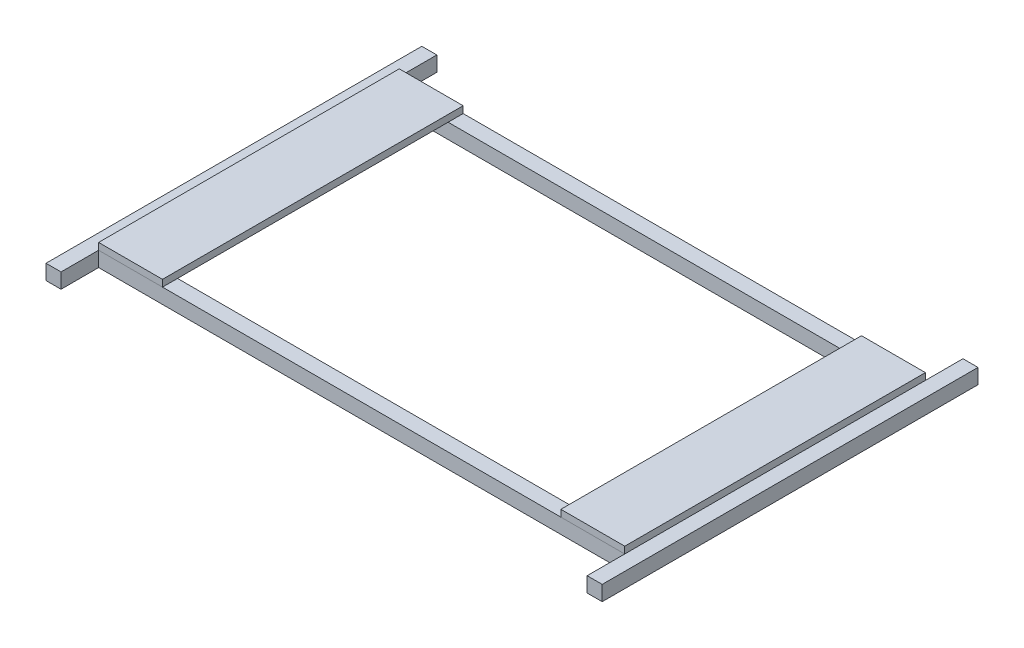
ISO-10303-21;
HEADER;
FILE_DESCRIPTION(('STEP AP214'),'2;1');
FILE_NAME('part.step','',(''),(''),'','','');
FILE_SCHEMA(('AUTOMOTIVE_DESIGN { 1 0 10303 214 1 1 1 1 }'));
ENDSEC;
DATA;
#1=APPLICATION_CONTEXT('core data for automotive mechanical design processes');
#2=APPLICATION_PROTOCOL_DEFINITION('international standard','automotive_design',2000,#1);
#3=PRODUCT_CONTEXT('',#1,'mechanical');
#4=PRODUCT('Part','Part','',(#3));
#5=PRODUCT_RELATED_PRODUCT_CATEGORY('part','',(#4));
#6=PRODUCT_DEFINITION_FORMATION('','',#4);
#7=PRODUCT_DEFINITION_CONTEXT('part definition',#1,'design');
#8=PRODUCT_DEFINITION('design','',#6,#7);
#9=PRODUCT_DEFINITION_SHAPE('','',#8);
#10=(LENGTH_UNIT() NAMED_UNIT(*) SI_UNIT(.MILLI.,.METRE.));
#11=(NAMED_UNIT(*) PLANE_ANGLE_UNIT() SI_UNIT($,.RADIAN.));
#12=(NAMED_UNIT(*) SI_UNIT($,.STERADIAN.) SOLID_ANGLE_UNIT());
#13=UNCERTAINTY_MEASURE_WITH_UNIT(LENGTH_MEASURE(1.E-05),#10,'distance_accuracy_value','');
#14=(GEOMETRIC_REPRESENTATION_CONTEXT(3) GLOBAL_UNCERTAINTY_ASSIGNED_CONTEXT((#13)) GLOBAL_UNIT_ASSIGNED_CONTEXT((#10,
#11,#12)) REPRESENTATION_CONTEXT('',''));
#15=CARTESIAN_POINT('',(0.,0.,0.));
#16=DIRECTION('',(0.,0.,1.));
#17=DIRECTION('',(1.,0.,0.));
#18=AXIS2_PLACEMENT_3D('',#15,#16,#17);
#19=CARTESIAN_POINT('',(365.272669908613,9.,-410.320607762815));
#20=DIRECTION('',(-1.,0.,0.));
#21=DIRECTION('',(0.,0.,1.));
#22=AXIS2_PLACEMENT_3D('',#19,#20,#21);
#23=PLANE('',#22);
#24=DIRECTION('',(0.,0.,-1.));
#25=VECTOR('',#24,1.);
#26=CARTESIAN_POINT('',(365.272669908613,0.,-410.320607762815));
#27=LINE('',#26,#25);
#28=CARTESIAN_POINT('',(365.272669908613,0.,-10.3206077628152));
#29=VERTEX_POINT('',#28);
#30=CARTESIAN_POINT('',(365.272669908613,0.,-410.320607762815));
#31=VERTEX_POINT('',#30);
#32=EDGE_CURVE('E111',#29,#31,#27,.T.);
#33=ORIENTED_EDGE('',*,*,#32,.T.);
#34=DIRECTION('',(0.,-1.,0.));
#35=VECTOR('',#34,1.);
#36=CARTESIAN_POINT('',(365.272669908613,9.,-410.320607762815));
#37=LINE('',#36,#35);
#38=CARTESIAN_POINT('',(365.272669908613,9.,-410.320607762815));
#39=VERTEX_POINT('',#38);
#40=EDGE_CURVE('E12',#39,#31,#37,.T.);
#41=ORIENTED_EDGE('',*,*,#40,.F.);
#42=DIRECTION('',(0.,0.,-1.));
#43=VECTOR('',#42,1.);
#44=CARTESIAN_POINT('',(365.272669908613,9.,-410.320607762815));
#45=LINE('',#44,#43);
#46=CARTESIAN_POINT('',(365.272669908613,9.,-10.3206077628152));
#47=VERTEX_POINT('',#46);
#48=EDGE_CURVE('E99',#47,#39,#45,.T.);
#49=ORIENTED_EDGE('',*,*,#48,.F.);
#50=DIRECTION('',(0.,-1.,0.));
#51=VECTOR('',#50,1.);
#52=CARTESIAN_POINT('',(365.272669908613,9.,-10.3206077628152));
#53=LINE('',#52,#51);
#54=EDGE_CURVE('E107',#47,#29,#53,.T.);
#55=ORIENTED_EDGE('',*,*,#54,.T.);
#56=EDGE_LOOP('',(#33,#41,#49,#55));
#57=FACE_BOUND('',#56,.T.);
#58=ADVANCED_FACE('F48',(#57),#23,.F.);
#59=CARTESIAN_POINT('',(365.272669908613,9.,-410.320607762815));
#60=DIRECTION('',(0.,0.,1.));
#61=DIRECTION('',(1.,0.,0.));
#62=AXIS2_PLACEMENT_3D('',#59,#60,#61);
#63=PLANE('',#62);
#64=DIRECTION('',(-1.,0.,0.));
#65=VECTOR('',#64,1.);
#66=CARTESIAN_POINT('',(365.272669908613,0.,-410.320607762815));
#67=LINE('',#66,#65);
#68=CARTESIAN_POINT('',(280.272669908613,0.,-410.320607762815));
#69=VERTEX_POINT('',#68);
#70=EDGE_CURVE('E103',#31,#69,#67,.T.);
#71=ORIENTED_EDGE('',*,*,#70,.T.);
#72=DIRECTION('',(0.,-1.,0.));
#73=VECTOR('',#72,1.);
#74=CARTESIAN_POINT('',(280.272669908613,9.,-410.320607762815));
#75=LINE('',#74,#73);
#76=CARTESIAN_POINT('',(280.272669908613,9.,-410.320607762815));
#77=VERTEX_POINT('',#76);
#78=EDGE_CURVE('E56',#77,#69,#75,.T.);
#79=ORIENTED_EDGE('',*,*,#78,.F.);
#80=DIRECTION('',(-1.,0.,0.));
#81=VECTOR('',#80,1.);
#82=CARTESIAN_POINT('',(365.272669908613,9.,-410.320607762815));
#83=LINE('',#82,#81);
#84=EDGE_CURVE('E94',#39,#77,#83,.T.);
#85=ORIENTED_EDGE('',*,*,#84,.F.);
#86=ORIENTED_EDGE('',*,*,#40,.T.);
#87=EDGE_LOOP('',(#71,#79,#85,#86));
#88=FACE_BOUND('',#87,.T.);
#89=ADVANCED_FACE('F102',(#88),#63,.F.);
#90=CARTESIAN_POINT('',(280.272669908613,9.,-410.320607762815));
#91=DIRECTION('',(1.,0.,0.));
#92=DIRECTION('',(0.,0.,-1.));
#93=AXIS2_PLACEMENT_3D('',#90,#91,#92);
#94=PLANE('',#93);
#95=DIRECTION('',(0.,0.,1.));
#96=VECTOR('',#95,1.);
#97=CARTESIAN_POINT('',(280.272669908613,0.,-410.320607762815));
#98=LINE('',#97,#96);
#99=CARTESIAN_POINT('',(280.272669908613,0.,-10.3206077628152));
#100=VERTEX_POINT('',#99);
#101=EDGE_CURVE('E81',#69,#100,#98,.T.);
#102=ORIENTED_EDGE('',*,*,#101,.T.);
#103=DIRECTION('',(0.,-1.,0.));
#104=VECTOR('',#103,1.);
#105=CARTESIAN_POINT('',(280.272669908613,9.,-10.3206077628152));
#106=LINE('',#105,#104);
#107=CARTESIAN_POINT('',(280.272669908613,9.,-10.3206077628152));
#108=VERTEX_POINT('',#107);
#109=EDGE_CURVE('E104',#108,#100,#106,.T.);
#110=ORIENTED_EDGE('',*,*,#109,.F.);
#111=DIRECTION('',(0.,0.,1.));
#112=VECTOR('',#111,1.);
#113=CARTESIAN_POINT('',(280.272669908613,9.,-410.320607762815));
#114=LINE('',#113,#112);
#115=EDGE_CURVE('E97',#77,#108,#114,.T.);
#116=ORIENTED_EDGE('',*,*,#115,.F.);
#117=ORIENTED_EDGE('',*,*,#78,.T.);
#118=EDGE_LOOP('',(#102,#110,#116,#117));
#119=FACE_BOUND('',#118,.T.);
#120=ADVANCED_FACE('F105',(#119),#94,.F.);
#121=CARTESIAN_POINT('',(365.272669908613,9.,-10.3206077628152));
#122=DIRECTION('',(0.,0.,-1.));
#123=DIRECTION('',(-1.,0.,0.));
#124=AXIS2_PLACEMENT_3D('',#121,#122,#123);
#125=PLANE('',#124);
#126=DIRECTION('',(1.,0.,0.));
#127=VECTOR('',#126,1.);
#128=CARTESIAN_POINT('',(365.272669908613,0.,-10.3206077628152));
#129=LINE('',#128,#127);
#130=EDGE_CURVE('E87',#100,#29,#129,.T.);
#131=ORIENTED_EDGE('',*,*,#130,.T.);
#132=ORIENTED_EDGE('',*,*,#54,.F.);
#133=DIRECTION('',(1.,0.,0.));
#134=VECTOR('',#133,1.);
#135=CARTESIAN_POINT('',(365.272669908613,9.,-10.3206077628152));
#136=LINE('',#135,#134);
#137=EDGE_CURVE('E64',#108,#47,#136,.T.);
#138=ORIENTED_EDGE('',*,*,#137,.F.);
#139=ORIENTED_EDGE('',*,*,#109,.T.);
#140=EDGE_LOOP('',(#131,#132,#138,#139));
#141=FACE_BOUND('',#140,.T.);
#142=ADVANCED_FACE('F118',(#141),#125,.F.);
#143=CARTESIAN_POINT('',(0.,9.,0.));
#144=DIRECTION('',(0.,-1.,0.));
#145=DIRECTION('',(0.,0.,-1.));
#146=AXIS2_PLACEMENT_3D('',#143,#144,#145);
#147=PLANE('',#146);
#148=ORIENTED_EDGE('',*,*,#48,.T.);
#149=ORIENTED_EDGE('',*,*,#84,.T.);
#150=ORIENTED_EDGE('',*,*,#115,.T.);
#151=ORIENTED_EDGE('',*,*,#137,.T.);
#152=EDGE_LOOP('',(#148,#149,#150,#151));
#153=FACE_BOUND('',#152,.T.);
#154=ADVANCED_FACE('F95',(#153),#147,.F.);
#155=CARTESIAN_POINT('',(0.,0.,0.));
#156=DIRECTION('',(0.,-1.,0.));
#157=DIRECTION('',(0.,0.,-1.));
#158=AXIS2_PLACEMENT_3D('',#155,#156,#157);
#159=PLANE('',#158);
#160=ORIENTED_EDGE('',*,*,#32,.F.);
#161=ORIENTED_EDGE('',*,*,#130,.F.);
#162=ORIENTED_EDGE('',*,*,#101,.F.);
#163=ORIENTED_EDGE('',*,*,#70,.F.);
#164=EDGE_LOOP('',(#160,#161,#162,#163));
#165=FACE_BOUND('',#164,.T.);
#166=ADVANCED_FACE('F121',(#165),#159,.T.);
#167=CLOSED_SHELL('',(#58,#89,#120,#142,#154,#166));
#168=MANIFOLD_SOLID_BREP('B2',#167);
#169=CARTESIAN_POINT('',(-334.727330091387,9.,-410.320607762815));
#170=DIRECTION('',(1.,0.,0.));
#171=DIRECTION('',(0.,0.,-1.));
#172=AXIS2_PLACEMENT_3D('',#169,#170,#171);
#173=PLANE('',#172);
#174=DIRECTION('',(0.,0.,1.));
#175=VECTOR('',#174,1.);
#176=CARTESIAN_POINT('',(-334.727330091387,0.,-410.320607762815));
#177=LINE('',#176,#175);
#178=CARTESIAN_POINT('',(-334.727330091387,0.,-410.320607762815));
#179=VERTEX_POINT('',#178);
#180=CARTESIAN_POINT('',(-334.727330091387,0.,-10.3206077628152));
#181=VERTEX_POINT('',#180);
#182=EDGE_CURVE('E244',#179,#181,#177,.T.);
#183=ORIENTED_EDGE('',*,*,#182,.T.);
#184=DIRECTION('',(0.,-1.,0.));
#185=VECTOR('',#184,1.);
#186=CARTESIAN_POINT('',(-334.727330091387,9.,-10.3206077628152));
#187=LINE('',#186,#185);
#188=CARTESIAN_POINT('',(-334.727330091387,9.,-10.3206077628152));
#189=VERTEX_POINT('',#188);
#190=EDGE_CURVE('E46',#189,#181,#187,.T.);
#191=ORIENTED_EDGE('',*,*,#190,.F.);
#192=DIRECTION('',(0.,0.,1.));
#193=VECTOR('',#192,1.);
#194=CARTESIAN_POINT('',(-334.727330091387,9.,-410.320607762815));
#195=LINE('',#194,#193);
#196=CARTESIAN_POINT('',(-334.727330091387,9.,-410.320607762815));
#197=VERTEX_POINT('',#196);
#198=EDGE_CURVE('E232',#197,#189,#195,.T.);
#199=ORIENTED_EDGE('',*,*,#198,.F.);
#200=DIRECTION('',(0.,-1.,0.));
#201=VECTOR('',#200,1.);
#202=CARTESIAN_POINT('',(-334.727330091387,9.,-410.320607762815));
#203=LINE('',#202,#201);
#204=EDGE_CURVE('E240',#197,#179,#203,.T.);
#205=ORIENTED_EDGE('',*,*,#204,.T.);
#206=EDGE_LOOP('',(#183,#191,#199,#205));
#207=FACE_BOUND('',#206,.T.);
#208=ADVANCED_FACE('F181',(#207),#173,.F.);
#209=CARTESIAN_POINT('',(-334.727330091387,9.,-10.3206077628152));
#210=DIRECTION('',(0.,0.,-1.));
#211=DIRECTION('',(-1.,0.,0.));
#212=AXIS2_PLACEMENT_3D('',#209,#210,#211);
#213=PLANE('',#212);
#214=DIRECTION('',(1.,0.,0.));
#215=VECTOR('',#214,1.);
#216=CARTESIAN_POINT('',(-334.727330091387,0.,-10.3206077628152));
#217=LINE('',#216,#215);
#218=CARTESIAN_POINT('',(-249.727330091387,0.,-10.3206077628152));
#219=VERTEX_POINT('',#218);
#220=EDGE_CURVE('E236',#181,#219,#217,.T.);
#221=ORIENTED_EDGE('',*,*,#220,.T.);
#222=DIRECTION('',(0.,-1.,0.));
#223=VECTOR('',#222,1.);
#224=CARTESIAN_POINT('',(-249.727330091387,9.,-10.3206077628152));
#225=LINE('',#224,#223);
#226=CARTESIAN_POINT('',(-249.727330091387,9.,-10.3206077628152));
#227=VERTEX_POINT('',#226);
#228=EDGE_CURVE('E189',#227,#219,#225,.T.);
#229=ORIENTED_EDGE('',*,*,#228,.F.);
#230=DIRECTION('',(1.,0.,0.));
#231=VECTOR('',#230,1.);
#232=CARTESIAN_POINT('',(-334.727330091387,9.,-10.3206077628152));
#233=LINE('',#232,#231);
#234=EDGE_CURVE('E227',#189,#227,#233,.T.);
#235=ORIENTED_EDGE('',*,*,#234,.F.);
#236=ORIENTED_EDGE('',*,*,#190,.T.);
#237=EDGE_LOOP('',(#221,#229,#235,#236));
#238=FACE_BOUND('',#237,.T.);
#239=ADVANCED_FACE('F235',(#238),#213,.F.);
#240=CARTESIAN_POINT('',(-249.727330091387,9.,-410.320607762815));
#241=DIRECTION('',(-1.,0.,0.));
#242=DIRECTION('',(0.,0.,1.));
#243=AXIS2_PLACEMENT_3D('',#240,#241,#242);
#244=PLANE('',#243);
#245=DIRECTION('',(0.,0.,-1.));
#246=VECTOR('',#245,1.);
#247=CARTESIAN_POINT('',(-249.727330091387,0.,-410.320607762815));
#248=LINE('',#247,#246);
#249=CARTESIAN_POINT('',(-249.727330091387,0.,-410.320607762815));
#250=VERTEX_POINT('',#249);
#251=EDGE_CURVE('E214',#219,#250,#248,.T.);
#252=ORIENTED_EDGE('',*,*,#251,.T.);
#253=DIRECTION('',(0.,-1.,0.));
#254=VECTOR('',#253,1.);
#255=CARTESIAN_POINT('',(-249.727330091387,9.,-410.320607762815));
#256=LINE('',#255,#254);
#257=CARTESIAN_POINT('',(-249.727330091387,9.,-410.320607762815));
#258=VERTEX_POINT('',#257);
#259=EDGE_CURVE('E237',#258,#250,#256,.T.);
#260=ORIENTED_EDGE('',*,*,#259,.F.);
#261=DIRECTION('',(0.,0.,-1.));
#262=VECTOR('',#261,1.);
#263=CARTESIAN_POINT('',(-249.727330091387,9.,-410.320607762815));
#264=LINE('',#263,#262);
#265=EDGE_CURVE('E230',#227,#258,#264,.T.);
#266=ORIENTED_EDGE('',*,*,#265,.F.);
#267=ORIENTED_EDGE('',*,*,#228,.T.);
#268=EDGE_LOOP('',(#252,#260,#266,#267));
#269=FACE_BOUND('',#268,.T.);
#270=ADVANCED_FACE('F238',(#269),#244,.F.);
#271=CARTESIAN_POINT('',(-334.727330091387,9.,-410.320607762815));
#272=DIRECTION('',(0.,0.,1.));
#273=DIRECTION('',(1.,0.,0.));
#274=AXIS2_PLACEMENT_3D('',#271,#272,#273);
#275=PLANE('',#274);
#276=DIRECTION('',(-1.,0.,0.));
#277=VECTOR('',#276,1.);
#278=CARTESIAN_POINT('',(-334.727330091387,0.,-410.320607762815));
#279=LINE('',#278,#277);
#280=EDGE_CURVE('E220',#250,#179,#279,.T.);
#281=ORIENTED_EDGE('',*,*,#280,.T.);
#282=ORIENTED_EDGE('',*,*,#204,.F.);
#283=DIRECTION('',(-1.,0.,0.));
#284=VECTOR('',#283,1.);
#285=CARTESIAN_POINT('',(-334.727330091387,9.,-410.320607762815));
#286=LINE('',#285,#284);
#287=EDGE_CURVE('E197',#258,#197,#286,.T.);
#288=ORIENTED_EDGE('',*,*,#287,.F.);
#289=ORIENTED_EDGE('',*,*,#259,.T.);
#290=EDGE_LOOP('',(#281,#282,#288,#289));
#291=FACE_BOUND('',#290,.T.);
#292=ADVANCED_FACE('F251',(#291),#275,.F.);
#293=CARTESIAN_POINT('',(0.,9.,0.));
#294=DIRECTION('',(0.,1.,0.));
#295=DIRECTION('',(0.,0.,1.));
#296=AXIS2_PLACEMENT_3D('',#293,#294,#295);
#297=PLANE('',#296);
#298=ORIENTED_EDGE('',*,*,#198,.T.);
#299=ORIENTED_EDGE('',*,*,#234,.T.);
#300=ORIENTED_EDGE('',*,*,#265,.T.);
#301=ORIENTED_EDGE('',*,*,#287,.T.);
#302=EDGE_LOOP('',(#298,#299,#300,#301));
#303=FACE_BOUND('',#302,.T.);
#304=ADVANCED_FACE('F228',(#303),#297,.T.);
#305=CARTESIAN_POINT('',(0.,0.,0.));
#306=DIRECTION('',(0.,1.,0.));
#307=DIRECTION('',(0.,0.,1.));
#308=AXIS2_PLACEMENT_3D('',#305,#306,#307);
#309=PLANE('',#308);
#310=ORIENTED_EDGE('',*,*,#182,.F.);
#311=ORIENTED_EDGE('',*,*,#280,.F.);
#312=ORIENTED_EDGE('',*,*,#251,.F.);
#313=ORIENTED_EDGE('',*,*,#220,.F.);
#314=EDGE_LOOP('',(#310,#311,#312,#313));
#315=FACE_BOUND('',#314,.T.);
#316=ADVANCED_FACE('F254',(#315),#309,.F.);
#317=CLOSED_SHELL('',(#208,#239,#270,#292,#304,#316));
#318=MANIFOLD_SOLID_BREP('B6',#317);
#319=CARTESIAN_POINT('',(0.,-20.,-30.3206077628152));
#320=DIRECTION('',(0.,0.,1.));
#321=DIRECTION('',(1.,0.,0.));
#322=AXIS2_PLACEMENT_3D('',#319,#320,#321);
#323=PLANE('',#322);
#324=DIRECTION('',(1.,0.,0.));
#325=VECTOR('',#324,1.);
#326=CARTESIAN_POINT('',(0.,0.,-30.3206077628152));
#327=LINE('',#326,#325);
#328=CARTESIAN_POINT('',(-334.727330091387,0.,-30.3206077628152));
#329=VERTEX_POINT('',#328);
#330=CARTESIAN_POINT('',(365.272669908613,0.,-30.3206077628152));
#331=VERTEX_POINT('',#330);
#332=EDGE_CURVE('E478',#329,#331,#327,.T.);
#333=ORIENTED_EDGE('',*,*,#332,.T.);
#334=DIRECTION('',(0.,1.,0.));
#335=VECTOR('',#334,1.);
#336=CARTESIAN_POINT('',(365.272669908613,-20.,-30.3206077628152));
#337=LINE('',#336,#335);
#338=CARTESIAN_POINT('',(365.272669908613,-20.,-30.3206077628152));
#339=VERTEX_POINT('',#338);
#340=EDGE_CURVE('E179',#339,#331,#337,.T.);
#341=ORIENTED_EDGE('',*,*,#340,.F.);
#342=DIRECTION('',(1.,0.,0.));
#343=VECTOR('',#342,1.);
#344=CARTESIAN_POINT('',(0.,-20.,-30.3206077628152));
#345=LINE('',#344,#343);
#346=CARTESIAN_POINT('',(-334.727330091387,-20.,-30.3206077628152));
#347=VERTEX_POINT('',#346);
#348=EDGE_CURVE('E324',#347,#339,#345,.T.);
#349=ORIENTED_EDGE('',*,*,#348,.F.);
#350=DIRECTION('',(0.,1.,0.));
#351=VECTOR('',#350,1.);
#352=CARTESIAN_POINT('',(-334.727330091387,-20.,-30.3206077628152));
#353=LINE('',#352,#351);
#354=EDGE_CURVE('E433',#347,#329,#353,.T.);
#355=ORIENTED_EDGE('',*,*,#354,.T.);
#356=EDGE_LOOP('',(#333,#341,#349,#355));
#357=FACE_BOUND('',#356,.T.);
#358=ADVANCED_FACE('F305',(#357),#323,.F.);
#359=CARTESIAN_POINT('',(365.272669908613,-20.,0.));
#360=DIRECTION('',(-1.,0.,0.));
#361=DIRECTION('',(0.,0.,1.));
#362=AXIS2_PLACEMENT_3D('',#359,#360,#361);
#363=PLANE('',#362);
#364=DIRECTION('',(0.,0.,1.));
#365=VECTOR('',#364,1.);
#366=CARTESIAN_POINT('',(365.272669908613,0.,0.));
#367=LINE('',#366,#365);
#368=CARTESIAN_POINT('',(365.272669908613,0.,-390.320607762815));
#369=VERTEX_POINT('',#368);
#370=EDGE_CURVE('E483',#369,#331,#367,.T.);
#371=ORIENTED_EDGE('',*,*,#370,.F.);
#372=DIRECTION('',(0.,1.,0.));
#373=VECTOR('',#372,1.);
#374=CARTESIAN_POINT('',(365.272669908613,-20.,-390.320607762815));
#375=LINE('',#374,#373);
#376=CARTESIAN_POINT('',(365.272669908613,-20.,-390.320607762815));
#377=VERTEX_POINT('',#376);
#378=EDGE_CURVE('E315',#377,#369,#375,.T.);
#379=ORIENTED_EDGE('',*,*,#378,.F.);
#380=DIRECTION('',(0.,0.,1.));
#381=VECTOR('',#380,1.);
#382=CARTESIAN_POINT('',(365.272669908613,-20.,0.));
#383=LINE('',#382,#381);
#384=EDGE_CURVE('E441',#377,#339,#383,.T.);
#385=ORIENTED_EDGE('',*,*,#384,.T.);
#386=ORIENTED_EDGE('',*,*,#340,.T.);
#387=EDGE_LOOP('',(#371,#379,#385,#386));
#388=FACE_BOUND('',#387,.T.);
#389=ADVANCED_FACE('F537',(#388),#363,.T.);
#390=CARTESIAN_POINT('',(0.,-20.,-390.320607762815));
#391=DIRECTION('',(0.,0.,1.));
#392=DIRECTION('',(1.,0.,0.));
#393=AXIS2_PLACEMENT_3D('',#390,#391,#392);
#394=PLANE('',#393);
#395=DIRECTION('',(1.,0.,0.));
#396=VECTOR('',#395,1.);
#397=CARTESIAN_POINT('',(0.,0.,-390.320607762815));
#398=LINE('',#397,#396);
#399=CARTESIAN_POINT('',(-334.727330091387,0.,-390.320607762815));
#400=VERTEX_POINT('',#399);
#401=EDGE_CURVE('E430',#400,#369,#398,.T.);
#402=ORIENTED_EDGE('',*,*,#401,.F.);
#403=DIRECTION('',(0.,1.,0.));
#404=VECTOR('',#403,1.);
#405=CARTESIAN_POINT('',(-334.727330091387,-20.,-390.320607762815));
#406=LINE('',#405,#404);
#407=CARTESIAN_POINT('',(-334.727330091387,-20.,-390.320607762815));
#408=VERTEX_POINT('',#407);
#409=EDGE_CURVE('E425',#408,#400,#406,.T.);
#410=ORIENTED_EDGE('',*,*,#409,.F.);
#411=DIRECTION('',(1.,0.,0.));
#412=VECTOR('',#411,1.);
#413=CARTESIAN_POINT('',(0.,-20.,-390.320607762815));
#414=LINE('',#413,#412);
#415=EDGE_CURVE('E429',#408,#377,#414,.T.);
#416=ORIENTED_EDGE('',*,*,#415,.T.);
#417=ORIENTED_EDGE('',*,*,#378,.T.);
#418=EDGE_LOOP('',(#402,#410,#416,#417));
#419=FACE_BOUND('',#418,.T.);
#420=ADVANCED_FACE('F427',(#419),#394,.T.);
#421=CARTESIAN_POINT('',(-334.727330091387,-20.,0.));
#422=DIRECTION('',(-1.,0.,0.));
#423=DIRECTION('',(0.,0.,1.));
#424=AXIS2_PLACEMENT_3D('',#421,#422,#423);
#425=PLANE('',#424);
#426=DIRECTION('',(0.,0.,1.));
#427=VECTOR('',#426,1.);
#428=CARTESIAN_POINT('',(-334.727330091387,0.,0.));
#429=LINE('',#428,#427);
#430=CARTESIAN_POINT('',(-334.727330091387,0.,-10.3206077628152));
#431=VERTEX_POINT('',#430);
#432=CARTESIAN_POINT('',(-334.727330091387,0.,39.6793922371848));
#433=VERTEX_POINT('',#432);
#434=EDGE_CURVE('E446',#431,#433,#429,.T.);
#435=ORIENTED_EDGE('',*,*,#434,.T.);
#436=DIRECTION('',(0.,1.,0.));
#437=VECTOR('',#436,1.);
#438=CARTESIAN_POINT('',(-334.727330091387,-20.,39.6793922371848));
#439=LINE('',#438,#437);
#440=CARTESIAN_POINT('',(-334.727330091387,-20.,39.6793922371848));
#441=VERTEX_POINT('',#440);
#442=EDGE_CURVE('E489',#441,#433,#439,.T.);
#443=ORIENTED_EDGE('',*,*,#442,.F.);
#444=DIRECTION('',(0.,0.,1.));
#445=VECTOR('',#444,1.);
#446=CARTESIAN_POINT('',(-334.727330091387,-20.,0.));
#447=LINE('',#446,#445);
#448=CARTESIAN_POINT('',(-334.727330091387,-20.,-10.3206077628152));
#449=VERTEX_POINT('',#448);
#450=EDGE_CURVE('E485',#449,#441,#447,.T.);
#451=ORIENTED_EDGE('',*,*,#450,.F.);
#452=DIRECTION('',(0.,1.,0.));
#453=VECTOR('',#452,1.);
#454=CARTESIAN_POINT('',(-334.727330091387,-20.,-10.3206077628152));
#455=LINE('',#454,#453);
#456=EDGE_CURVE('E309',#449,#431,#455,.T.);
#457=ORIENTED_EDGE('',*,*,#456,.T.);
#458=EDGE_LOOP('',(#435,#443,#451,#457));
#459=FACE_BOUND('',#458,.T.);
#460=ADVANCED_FACE('F307',(#459),#425,.F.);
#461=CARTESIAN_POINT('',(0.,-20.,39.6793922371847));
#462=DIRECTION('',(0.,0.,-1.));
#463=DIRECTION('',(-1.,0.,0.));
#464=AXIS2_PLACEMENT_3D('',#461,#462,#463);
#465=PLANE('',#464);
#466=DIRECTION('',(-1.,0.,0.));
#467=VECTOR('',#466,1.);
#468=CARTESIAN_POINT('',(0.,0.,39.6793922371847));
#469=LINE('',#468,#467);
#470=CARTESIAN_POINT('',(-354.727330091387,0.,39.6793922371848));
#471=VERTEX_POINT('',#470);
#472=EDGE_CURVE('E476',#433,#471,#469,.T.);
#473=ORIENTED_EDGE('',*,*,#472,.T.);
#474=DIRECTION('',(0.,1.,0.));
#475=VECTOR('',#474,1.);
#476=CARTESIAN_POINT('',(-354.727330091387,-20.,39.6793922371848));
#477=LINE('',#476,#475);
#478=CARTESIAN_POINT('',(-354.727330091387,-20.,39.6793922371848));
#479=VERTEX_POINT('',#478);
#480=EDGE_CURVE('E492',#479,#471,#477,.T.);
#481=ORIENTED_EDGE('',*,*,#480,.F.);
#482=DIRECTION('',(-1.,0.,0.));
#483=VECTOR('',#482,1.);
#484=CARTESIAN_POINT('',(0.,-20.,39.6793922371847));
#485=LINE('',#484,#483);
#486=EDGE_CURVE('E613',#441,#479,#485,.T.);
#487=ORIENTED_EDGE('',*,*,#486,.F.);
#488=ORIENTED_EDGE('',*,*,#442,.T.);
#489=EDGE_LOOP('',(#473,#481,#487,#488));
#490=FACE_BOUND('',#489,.T.);
#491=ADVANCED_FACE('F546',(#490),#465,.F.);
#492=CARTESIAN_POINT('',(-354.727330091387,-20.,0.));
#493=DIRECTION('',(1.,0.,0.));
#494=DIRECTION('',(0.,0.,-1.));
#495=AXIS2_PLACEMENT_3D('',#492,#493,#494);
#496=PLANE('',#495);
#497=DIRECTION('',(0.,0.,-1.));
#498=VECTOR('',#497,1.);
#499=CARTESIAN_POINT('',(-354.727330091387,0.,0.));
#500=LINE('',#499,#498);
#501=CARTESIAN_POINT('',(-354.727330091387,0.,-460.320607762815));
#502=VERTEX_POINT('',#501);
#503=EDGE_CURVE('E474',#471,#502,#500,.T.);
#504=ORIENTED_EDGE('',*,*,#503,.T.);
#505=DIRECTION('',(0.,1.,0.));
#506=VECTOR('',#505,1.);
#507=CARTESIAN_POINT('',(-354.727330091387,-20.,-460.320607762815));
#508=LINE('',#507,#506);
#509=CARTESIAN_POINT('',(-354.727330091387,-20.,-460.320607762815));
#510=VERTEX_POINT('',#509);
#511=EDGE_CURVE('E495',#510,#502,#508,.T.);
#512=ORIENTED_EDGE('',*,*,#511,.F.);
#513=DIRECTION('',(0.,0.,-1.));
#514=VECTOR('',#513,1.);
#515=CARTESIAN_POINT('',(-354.727330091387,-20.,0.));
#516=LINE('',#515,#514);
#517=EDGE_CURVE('E611',#479,#510,#516,.T.);
#518=ORIENTED_EDGE('',*,*,#517,.F.);
#519=ORIENTED_EDGE('',*,*,#480,.T.);
#520=EDGE_LOOP('',(#504,#512,#518,#519));
#521=FACE_BOUND('',#520,.T.);
#522=ADVANCED_FACE('F549',(#521),#496,.F.);
#523=CARTESIAN_POINT('',(0.,-20.,-460.320607762815));
#524=DIRECTION('',(0.,0.,1.));
#525=DIRECTION('',(1.,0.,0.));
#526=AXIS2_PLACEMENT_3D('',#523,#524,#525);
#527=PLANE('',#526);
#528=DIRECTION('',(1.,0.,0.));
#529=VECTOR('',#528,1.);
#530=CARTESIAN_POINT('',(0.,0.,-460.320607762815));
#531=LINE('',#530,#529);
#532=CARTESIAN_POINT('',(-334.727330091387,0.,-460.320607762815));
#533=VERTEX_POINT('',#532);
#534=EDGE_CURVE('E472',#502,#533,#531,.T.);
#535=ORIENTED_EDGE('',*,*,#534,.T.);
#536=DIRECTION('',(0.,1.,0.));
#537=VECTOR('',#536,1.);
#538=CARTESIAN_POINT('',(-334.727330091387,-20.,-460.320607762815));
#539=LINE('',#538,#537);
#540=CARTESIAN_POINT('',(-334.727330091387,-20.,-460.320607762815));
#541=VERTEX_POINT('',#540);
#542=EDGE_CURVE('E498',#541,#533,#539,.T.);
#543=ORIENTED_EDGE('',*,*,#542,.F.);
#544=DIRECTION('',(1.,0.,0.));
#545=VECTOR('',#544,1.);
#546=CARTESIAN_POINT('',(0.,-20.,-460.320607762815));
#547=LINE('',#546,#545);
#548=EDGE_CURVE('E609',#510,#541,#547,.T.);
#549=ORIENTED_EDGE('',*,*,#548,.F.);
#550=ORIENTED_EDGE('',*,*,#511,.T.);
#551=EDGE_LOOP('',(#535,#543,#549,#550));
#552=FACE_BOUND('',#551,.T.);
#553=ADVANCED_FACE('F553',(#552),#527,.F.);
#554=CARTESIAN_POINT('',(-334.727330091387,-20.,0.));
#555=DIRECTION('',(-1.,0.,0.));
#556=DIRECTION('',(0.,0.,1.));
#557=AXIS2_PLACEMENT_3D('',#554,#555,#556);
#558=PLANE('',#557);
#559=DIRECTION('',(0.,0.,1.));
#560=VECTOR('',#559,1.);
#561=CARTESIAN_POINT('',(-334.727330091387,0.,0.));
#562=LINE('',#561,#560);
#563=CARTESIAN_POINT('',(-334.727330091387,0.,-410.320607762815));
#564=VERTEX_POINT('',#563);
#565=EDGE_CURVE('E470',#533,#564,#562,.T.);
#566=ORIENTED_EDGE('',*,*,#565,.T.);
#567=DIRECTION('',(0.,1.,0.));
#568=VECTOR('',#567,1.);
#569=CARTESIAN_POINT('',(-334.727330091387,-20.,-410.320607762815));
#570=LINE('',#569,#568);
#571=CARTESIAN_POINT('',(-334.727330091387,-20.,-410.320607762815));
#572=VERTEX_POINT('',#571);
#573=EDGE_CURVE('E501',#572,#564,#570,.T.);
#574=ORIENTED_EDGE('',*,*,#573,.F.);
#575=DIRECTION('',(0.,0.,1.));
#576=VECTOR('',#575,1.);
#577=CARTESIAN_POINT('',(-334.727330091387,-20.,0.));
#578=LINE('',#577,#576);
#579=EDGE_CURVE('E607',#541,#572,#578,.T.);
#580=ORIENTED_EDGE('',*,*,#579,.F.);
#581=ORIENTED_EDGE('',*,*,#542,.T.);
#582=EDGE_LOOP('',(#566,#574,#580,#581));
#583=FACE_BOUND('',#582,.T.);
#584=ADVANCED_FACE('F557',(#583),#558,.F.);
#585=CARTESIAN_POINT('',(0.,-20.,-410.320607762815));
#586=DIRECTION('',(0.,0.,1.));
#587=DIRECTION('',(1.,0.,0.));
#588=AXIS2_PLACEMENT_3D('',#585,#586,#587);
#589=PLANE('',#588);
#590=DIRECTION('',(1.,0.,0.));
#591=VECTOR('',#590,1.);
#592=CARTESIAN_POINT('',(0.,0.,-410.320607762815));
#593=LINE('',#592,#591);
#594=CARTESIAN_POINT('',(365.272669908613,0.,-410.320607762815));
#595=VERTEX_POINT('',#594);
#596=EDGE_CURVE('E467',#564,#595,#593,.T.);
#597=ORIENTED_EDGE('',*,*,#596,.T.);
#598=DIRECTION('',(0.,1.,0.));
#599=VECTOR('',#598,1.);
#600=CARTESIAN_POINT('',(365.272669908613,-20.,-410.320607762815));
#601=LINE('',#600,#599);
#602=CARTESIAN_POINT('',(365.272669908613,-20.,-410.320607762815));
#603=VERTEX_POINT('',#602);
#604=EDGE_CURVE('E504',#603,#595,#601,.T.);
#605=ORIENTED_EDGE('',*,*,#604,.F.);
#606=DIRECTION('',(1.,0.,0.));
#607=VECTOR('',#606,1.);
#608=CARTESIAN_POINT('',(0.,-20.,-410.320607762815));
#609=LINE('',#608,#607);
#610=EDGE_CURVE('E605',#572,#603,#609,.T.);
#611=ORIENTED_EDGE('',*,*,#610,.F.);
#612=ORIENTED_EDGE('',*,*,#573,.T.);
#613=EDGE_LOOP('',(#597,#605,#611,#612));
#614=FACE_BOUND('',#613,.T.);
#615=ADVANCED_FACE('F561',(#614),#589,.F.);
#616=CARTESIAN_POINT('',(365.272669908613,-20.,0.));
#617=DIRECTION('',(-1.,0.,0.));
#618=DIRECTION('',(0.,0.,1.));
#619=AXIS2_PLACEMENT_3D('',#616,#617,#618);
#620=PLANE('',#619);
#621=DIRECTION('',(0.,0.,1.));
#622=VECTOR('',#621,1.);
#623=CARTESIAN_POINT('',(365.272669908613,0.,0.));
#624=LINE('',#623,#622);
#625=CARTESIAN_POINT('',(365.272669908613,0.,-460.320607762815));
#626=VERTEX_POINT('',#625);
#627=EDGE_CURVE('E464',#626,#595,#624,.T.);
#628=ORIENTED_EDGE('',*,*,#627,.F.);
#629=DIRECTION('',(0.,1.,0.));
#630=VECTOR('',#629,1.);
#631=CARTESIAN_POINT('',(365.272669908613,-20.,-460.320607762815));
#632=LINE('',#631,#630);
#633=CARTESIAN_POINT('',(365.272669908613,-20.,-460.320607762815));
#634=VERTEX_POINT('',#633);
#635=EDGE_CURVE('E506',#634,#626,#632,.T.);
#636=ORIENTED_EDGE('',*,*,#635,.F.);
#637=DIRECTION('',(0.,0.,1.));
#638=VECTOR('',#637,1.);
#639=CARTESIAN_POINT('',(365.272669908613,-20.,0.));
#640=LINE('',#639,#638);
#641=EDGE_CURVE('E602',#634,#603,#640,.T.);
#642=ORIENTED_EDGE('',*,*,#641,.T.);
#643=ORIENTED_EDGE('',*,*,#604,.T.);
#644=EDGE_LOOP('',(#628,#636,#642,#643));
#645=FACE_BOUND('',#644,.T.);
#646=ADVANCED_FACE('F565',(#645),#620,.T.);
#647=CARTESIAN_POINT('',(0.,-20.,-460.320607762815));
#648=DIRECTION('',(0.,0.,1.));
#649=DIRECTION('',(1.,0.,0.));
#650=AXIS2_PLACEMENT_3D('',#647,#648,#649);
#651=PLANE('',#650);
#652=DIRECTION('',(1.,0.,0.));
#653=VECTOR('',#652,1.);
#654=CARTESIAN_POINT('',(0.,0.,-460.320607762815));
#655=LINE('',#654,#653);
#656=CARTESIAN_POINT('',(385.272669908613,0.,-460.320607762815));
#657=VERTEX_POINT('',#656);
#658=EDGE_CURVE('E461',#626,#657,#655,.T.);
#659=ORIENTED_EDGE('',*,*,#658,.T.);
#660=DIRECTION('',(0.,1.,0.));
#661=VECTOR('',#660,1.);
#662=CARTESIAN_POINT('',(385.272669908613,-20.,-460.320607762815));
#663=LINE('',#662,#661);
#664=CARTESIAN_POINT('',(385.272669908613,-20.,-460.320607762815));
#665=VERTEX_POINT('',#664);
#666=EDGE_CURVE('E508',#665,#657,#663,.T.);
#667=ORIENTED_EDGE('',*,*,#666,.F.);
#668=DIRECTION('',(1.,0.,0.));
#669=VECTOR('',#668,1.);
#670=CARTESIAN_POINT('',(0.,-20.,-460.320607762815));
#671=LINE('',#670,#669);
#672=EDGE_CURVE('E597',#634,#665,#671,.T.);
#673=ORIENTED_EDGE('',*,*,#672,.F.);
#674=ORIENTED_EDGE('',*,*,#635,.T.);
#675=EDGE_LOOP('',(#659,#667,#673,#674));
#676=FACE_BOUND('',#675,.T.);
#677=ADVANCED_FACE('F569',(#676),#651,.F.);
#678=CARTESIAN_POINT('',(385.272669908613,-20.,-1.60401970834256E-13));
#679=DIRECTION('',(1.,0.,0.));
#680=DIRECTION('',(0.,0.,-1.));
#681=AXIS2_PLACEMENT_3D('',#678,#679,#680);
#682=PLANE('',#681);
#683=DIRECTION('',(0.,0.,-1.));
#684=VECTOR('',#683,1.);
#685=CARTESIAN_POINT('',(385.272669908613,0.,-1.60401970834256E-13));
#686=LINE('',#685,#684);
#687=CARTESIAN_POINT('',(385.272669908613,0.,39.6793922371848));
#688=VERTEX_POINT('',#687);
#689=EDGE_CURVE('E458',#688,#657,#686,.T.);
#690=ORIENTED_EDGE('',*,*,#689,.F.);
#691=DIRECTION('',(0.,1.,0.));
#692=VECTOR('',#691,1.);
#693=CARTESIAN_POINT('',(385.272669908613,-20.,39.6793922371848));
#694=LINE('',#693,#692);
#695=CARTESIAN_POINT('',(385.272669908613,-20.,39.6793922371848));
#696=VERTEX_POINT('',#695);
#697=EDGE_CURVE('E510',#696,#688,#694,.T.);
#698=ORIENTED_EDGE('',*,*,#697,.F.);
#699=DIRECTION('',(0.,0.,-1.));
#700=VECTOR('',#699,1.);
#701=CARTESIAN_POINT('',(385.272669908613,-20.,-1.60401970834256E-13));
#702=LINE('',#701,#700);
#703=EDGE_CURVE('E595',#696,#665,#702,.T.);
#704=ORIENTED_EDGE('',*,*,#703,.T.);
#705=ORIENTED_EDGE('',*,*,#666,.T.);
#706=EDGE_LOOP('',(#690,#698,#704,#705));
#707=FACE_BOUND('',#706,.T.);
#708=ADVANCED_FACE('F573',(#707),#682,.T.);
#709=CARTESIAN_POINT('',(0.,-20.,39.6793922371849));
#710=DIRECTION('',(0.,0.,1.));
#711=DIRECTION('',(1.,0.,0.));
#712=AXIS2_PLACEMENT_3D('',#709,#710,#711);
#713=PLANE('',#712);
#714=DIRECTION('',(1.,0.,0.));
#715=VECTOR('',#714,1.);
#716=CARTESIAN_POINT('',(0.,0.,39.6793922371849));
#717=LINE('',#716,#715);
#718=CARTESIAN_POINT('',(365.272669908613,0.,39.6793922371848));
#719=VERTEX_POINT('',#718);
#720=EDGE_CURVE('E455',#719,#688,#717,.T.);
#721=ORIENTED_EDGE('',*,*,#720,.F.);
#722=DIRECTION('',(0.,1.,0.));
#723=VECTOR('',#722,1.);
#724=CARTESIAN_POINT('',(365.272669908613,-20.,39.6793922371848));
#725=LINE('',#724,#723);
#726=CARTESIAN_POINT('',(365.272669908613,-20.,39.6793922371848));
#727=VERTEX_POINT('',#726);
#728=EDGE_CURVE('E512',#727,#719,#725,.T.);
#729=ORIENTED_EDGE('',*,*,#728,.F.);
#730=DIRECTION('',(1.,0.,0.));
#731=VECTOR('',#730,1.);
#732=CARTESIAN_POINT('',(0.,-20.,39.6793922371849));
#733=LINE('',#732,#731);
#734=EDGE_CURVE('E590',#727,#696,#733,.T.);
#735=ORIENTED_EDGE('',*,*,#734,.T.);
#736=ORIENTED_EDGE('',*,*,#697,.T.);
#737=EDGE_LOOP('',(#721,#729,#735,#736));
#738=FACE_BOUND('',#737,.T.);
#739=ADVANCED_FACE('F533',(#738),#713,.T.);
#740=CARTESIAN_POINT('',(365.272669908613,-20.,0.));
#741=DIRECTION('',(1.,0.,0.));
#742=DIRECTION('',(0.,0.,-1.));
#743=AXIS2_PLACEMENT_3D('',#740,#741,#742);
#744=PLANE('',#743);
#745=DIRECTION('',(0.,0.,-1.));
#746=VECTOR('',#745,1.);
#747=CARTESIAN_POINT('',(365.272669908613,0.,0.));
#748=LINE('',#747,#746);
#749=CARTESIAN_POINT('',(365.272669908613,0.,-10.3206077628152));
#750=VERTEX_POINT('',#749);
#751=EDGE_CURVE('E452',#719,#750,#748,.T.);
#752=ORIENTED_EDGE('',*,*,#751,.T.);
#753=DIRECTION('',(0.,1.,0.));
#754=VECTOR('',#753,1.);
#755=CARTESIAN_POINT('',(365.272669908613,-20.,-10.3206077628152));
#756=LINE('',#755,#754);
#757=CARTESIAN_POINT('',(365.272669908613,-20.,-10.3206077628152));
#758=VERTEX_POINT('',#757);
#759=EDGE_CURVE('E513',#758,#750,#756,.T.);
#760=ORIENTED_EDGE('',*,*,#759,.F.);
#761=DIRECTION('',(0.,0.,-1.));
#762=VECTOR('',#761,1.);
#763=CARTESIAN_POINT('',(365.272669908613,-20.,0.));
#764=LINE('',#763,#762);
#765=EDGE_CURVE('E587',#727,#758,#764,.T.);
#766=ORIENTED_EDGE('',*,*,#765,.F.);
#767=ORIENTED_EDGE('',*,*,#728,.T.);
#768=EDGE_LOOP('',(#752,#760,#766,#767));
#769=FACE_BOUND('',#768,.T.);
#770=ADVANCED_FACE('F527',(#769),#744,.F.);
#771=CARTESIAN_POINT('',(0.,-20.,-10.3206077628152));
#772=DIRECTION('',(0.,0.,1.));
#773=DIRECTION('',(1.,0.,0.));
#774=AXIS2_PLACEMENT_3D('',#771,#772,#773);
#775=PLANE('',#774);
#776=DIRECTION('',(1.,0.,0.));
#777=VECTOR('',#776,1.);
#778=CARTESIAN_POINT('',(0.,0.,-10.3206077628152));
#779=LINE('',#778,#777);
#780=EDGE_CURVE('E449',#431,#750,#779,.T.);
#781=ORIENTED_EDGE('',*,*,#780,.F.);
#782=ORIENTED_EDGE('',*,*,#456,.F.);
#783=DIRECTION('',(1.,0.,0.));
#784=VECTOR('',#783,1.);
#785=CARTESIAN_POINT('',(0.,-20.,-10.3206077628152));
#786=LINE('',#785,#784);
#787=EDGE_CURVE('E591',#449,#758,#786,.T.);
#788=ORIENTED_EDGE('',*,*,#787,.T.);
#789=ORIENTED_EDGE('',*,*,#759,.T.);
#790=EDGE_LOOP('',(#781,#782,#788,#789));
#791=FACE_BOUND('',#790,.T.);
#792=ADVANCED_FACE('F525',(#791),#775,.T.);
#793=CARTESIAN_POINT('',(-334.727330091387,-20.,0.));
#794=DIRECTION('',(-1.,0.,0.));
#795=DIRECTION('',(0.,0.,1.));
#796=AXIS2_PLACEMENT_3D('',#793,#794,#795);
#797=PLANE('',#796);
#798=DIRECTION('',(0.,0.,1.));
#799=VECTOR('',#798,1.);
#800=CARTESIAN_POINT('',(-334.727330091387,0.,0.));
#801=LINE('',#800,#799);
#802=EDGE_CURVE('E480',#400,#329,#801,.T.);
#803=ORIENTED_EDGE('',*,*,#802,.T.);
#804=ORIENTED_EDGE('',*,*,#354,.F.);
#805=DIRECTION('',(0.,0.,1.));
#806=VECTOR('',#805,1.);
#807=CARTESIAN_POINT('',(-334.727330091387,-20.,0.));
#808=LINE('',#807,#806);
#809=EDGE_CURVE('E436',#408,#347,#808,.T.);
#810=ORIENTED_EDGE('',*,*,#809,.F.);
#811=ORIENTED_EDGE('',*,*,#409,.T.);
#812=EDGE_LOOP('',(#803,#804,#810,#811));
#813=FACE_BOUND('',#812,.T.);
#814=ADVANCED_FACE('F437',(#813),#797,.F.);
#815=CARTESIAN_POINT('',(0.,-20.,0.));
#816=DIRECTION('',(0.,1.,0.));
#817=DIRECTION('',(0.,0.,1.));
#818=AXIS2_PLACEMENT_3D('',#815,#816,#817);
#819=PLANE('',#818);
#820=ORIENTED_EDGE('',*,*,#450,.T.);
#821=ORIENTED_EDGE('',*,*,#486,.T.);
#822=ORIENTED_EDGE('',*,*,#517,.T.);
#823=ORIENTED_EDGE('',*,*,#548,.T.);
#824=ORIENTED_EDGE('',*,*,#579,.T.);
#825=ORIENTED_EDGE('',*,*,#610,.T.);
#826=ORIENTED_EDGE('',*,*,#641,.F.);
#827=ORIENTED_EDGE('',*,*,#672,.T.);
#828=ORIENTED_EDGE('',*,*,#703,.F.);
#829=ORIENTED_EDGE('',*,*,#734,.F.);
#830=ORIENTED_EDGE('',*,*,#765,.T.);
#831=ORIENTED_EDGE('',*,*,#787,.F.);
#832=EDGE_LOOP('',(#820,#821,#822,#823,#824,#825,#826,#827,#828,#829,#830,#831));
#833=FACE_BOUND('',#832,.T.);
#834=ORIENTED_EDGE('',*,*,#348,.T.);
#835=ORIENTED_EDGE('',*,*,#384,.F.);
#836=ORIENTED_EDGE('',*,*,#415,.F.);
#837=ORIENTED_EDGE('',*,*,#809,.T.);
#838=EDGE_LOOP('',(#834,#835,#836,#837));
#839=FACE_BOUND('',#838,.T.);
#840=ADVANCED_FACE('F440',(#833,#839),#819,.F.);
#841=CARTESIAN_POINT('',(0.,0.,0.));
#842=DIRECTION('',(0.,1.,0.));
#843=DIRECTION('',(0.,0.,1.));
#844=AXIS2_PLACEMENT_3D('',#841,#842,#843);
#845=PLANE('',#844);
#846=ORIENTED_EDGE('',*,*,#434,.F.);
#847=ORIENTED_EDGE('',*,*,#780,.T.);
#848=ORIENTED_EDGE('',*,*,#751,.F.);
#849=ORIENTED_EDGE('',*,*,#720,.T.);
#850=ORIENTED_EDGE('',*,*,#689,.T.);
#851=ORIENTED_EDGE('',*,*,#658,.F.);
#852=ORIENTED_EDGE('',*,*,#627,.T.);
#853=ORIENTED_EDGE('',*,*,#596,.F.);
#854=ORIENTED_EDGE('',*,*,#565,.F.);
#855=ORIENTED_EDGE('',*,*,#534,.F.);
#856=ORIENTED_EDGE('',*,*,#503,.F.);
#857=ORIENTED_EDGE('',*,*,#472,.F.);
#858=EDGE_LOOP('',(#846,#847,#848,#849,#850,#851,#852,#853,#854,#855,#856,#857));
#859=FACE_BOUND('',#858,.T.);
#860=ORIENTED_EDGE('',*,*,#332,.F.);
#861=ORIENTED_EDGE('',*,*,#802,.F.);
#862=ORIENTED_EDGE('',*,*,#401,.T.);
#863=ORIENTED_EDGE('',*,*,#370,.T.);
#864=EDGE_LOOP('',(#860,#861,#862,#863));
#865=FACE_BOUND('',#864,.T.);
#866=ADVANCED_FACE('F521',(#859,#865),#845,.T.);
#867=CLOSED_SHELL('',(#358,#389,#420,#460,#491,#522,#553,#584,#615,#646,#677,#708,#739,#770,
#792,#814,#840,#866));
#868=MANIFOLD_SOLID_BREP('B40',#867);
#869=ADVANCED_BREP_SHAPE_REPRESENTATION('',(#18,#168,#318,#868),#14);
#870=SHAPE_DEFINITION_REPRESENTATION(#9,#869);
ENDSEC;
END-ISO-10303-21;
